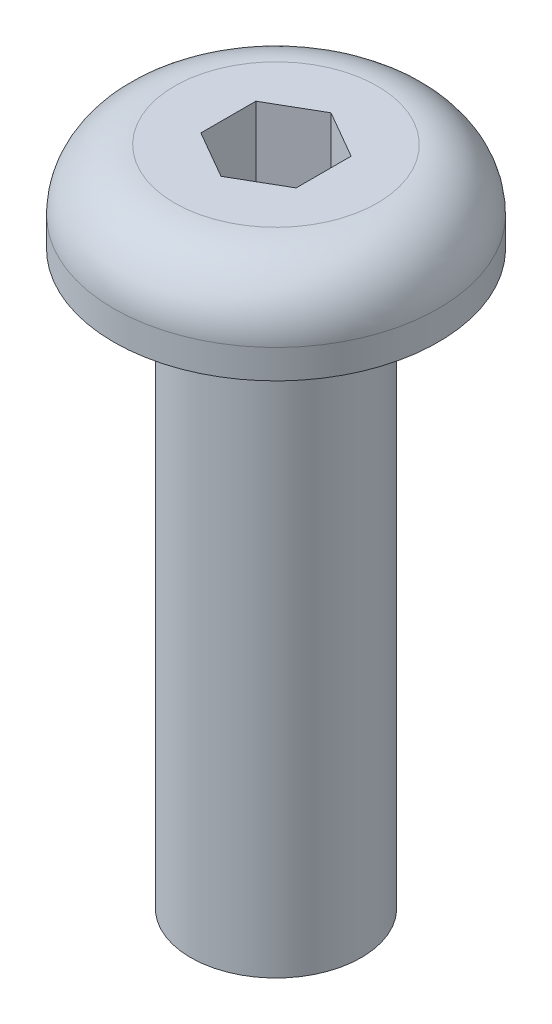
ISO-10303-21;
HEADER;
FILE_DESCRIPTION(('STEP AP214'),'2;1');
FILE_NAME('part.step','',(''),(''),'','','');
FILE_SCHEMA(('AUTOMOTIVE_DESIGN { 1 0 10303 214 1 1 1 1 }'));
ENDSEC;
DATA;
#1=APPLICATION_CONTEXT('core data for automotive mechanical design processes');
#2=APPLICATION_PROTOCOL_DEFINITION('international standard','automotive_design',2000,#1);
#3=PRODUCT_CONTEXT('',#1,'mechanical');
#4=PRODUCT('Part','Part','',(#3));
#5=PRODUCT_RELATED_PRODUCT_CATEGORY('part','',(#4));
#6=PRODUCT_DEFINITION_FORMATION('','',#4);
#7=PRODUCT_DEFINITION_CONTEXT('part definition',#1,'design');
#8=PRODUCT_DEFINITION('design','',#6,#7);
#9=PRODUCT_DEFINITION_SHAPE('','',#8);
#10=(LENGTH_UNIT() NAMED_UNIT(*) SI_UNIT(.MILLI.,.METRE.));
#11=(NAMED_UNIT(*) PLANE_ANGLE_UNIT() SI_UNIT($,.RADIAN.));
#12=(NAMED_UNIT(*) SI_UNIT($,.STERADIAN.) SOLID_ANGLE_UNIT());
#13=UNCERTAINTY_MEASURE_WITH_UNIT(LENGTH_MEASURE(1.E-05),#10,'distance_accuracy_value','');
#14=(GEOMETRIC_REPRESENTATION_CONTEXT(3) GLOBAL_UNCERTAINTY_ASSIGNED_CONTEXT((#13)) GLOBAL_UNIT_ASSIGNED_CONTEXT((#10,
#11,#12)) REPRESENTATION_CONTEXT('',''));
#15=CARTESIAN_POINT('',(0.,0.,0.));
#16=DIRECTION('',(0.,0.,1.));
#17=DIRECTION('',(1.,0.,0.));
#18=AXIS2_PLACEMENT_3D('',#15,#16,#17);
#19=CARTESIAN_POINT('',(0.,9.525,0.));
#20=DIRECTION('',(0.,-1.,0.));
#21=DIRECTION('',(0.,0.,-1.));
#22=AXIS2_PLACEMENT_3D('',#19,#20,#21);
#23=CYLINDRICAL_SURFACE('',#22,1.4224);
#24=CARTESIAN_POINT('',(0.,9.525,0.));
#25=DIRECTION('',(0.,1.,0.));
#26=DIRECTION('',(0.,0.,1.));
#27=AXIS2_PLACEMENT_3D('',#24,#25,#26);
#28=CIRCLE('',#27,1.4224);
#29=CARTESIAN_POINT('',(0.,9.525,1.4224));
#30=VERTEX_POINT('',#29);
#31=EDGE_CURVE('E141',#30,#30,#28,.T.);
#32=ORIENTED_EDGE('',*,*,#31,.F.);
#33=EDGE_LOOP('',(#32));
#34=FACE_BOUND('',#33,.T.);
#35=CARTESIAN_POINT('',(0.,0.,0.));
#36=DIRECTION('',(0.,1.,0.));
#37=DIRECTION('',(0.,0.,1.));
#38=AXIS2_PLACEMENT_3D('',#35,#36,#37);
#39=CIRCLE('',#38,1.4224);
#40=CARTESIAN_POINT('',(0.,0.,1.4224));
#41=VERTEX_POINT('',#40);
#42=EDGE_CURVE('E140',#41,#41,#39,.T.);
#43=ORIENTED_EDGE('',*,*,#42,.T.);
#44=EDGE_LOOP('',(#43));
#45=FACE_BOUND('',#44,.T.);
#46=ADVANCED_FACE('F30',(#34,#45),#23,.T.);
#47=CARTESIAN_POINT('',(0.,0.,0.));
#48=DIRECTION('',(0.,1.,0.));
#49=DIRECTION('',(0.,0.,1.));
#50=AXIS2_PLACEMENT_3D('',#47,#48,#49);
#51=PLANE('',#50);
#52=ORIENTED_EDGE('',*,*,#42,.F.);
#53=EDGE_LOOP('',(#52));
#54=FACE_BOUND('',#53,.T.);
#55=ADVANCED_FACE('F164',(#54),#51,.F.);
#56=CARTESIAN_POINT('',(0.,9.525,0.));
#57=DIRECTION('',(0.,1.,0.));
#58=DIRECTION('',(0.,0.,1.));
#59=AXIS2_PLACEMENT_3D('',#56,#57,#58);
#60=PLANE('',#59);
#61=CARTESIAN_POINT('',(0.,9.525,0.));
#62=DIRECTION('',(0.,1.,0.));
#63=DIRECTION('',(0.,0.,1.));
#64=AXIS2_PLACEMENT_3D('',#61,#62,#63);
#65=CIRCLE('',#64,2.7051);
#66=CARTESIAN_POINT('',(0.,9.525,2.7051));
#67=VERTEX_POINT('',#66);
#68=EDGE_CURVE('E132',#67,#67,#65,.T.);
#69=ORIENTED_EDGE('',*,*,#68,.F.);
#70=EDGE_LOOP('',(#69));
#71=FACE_BOUND('',#70,.T.);
#72=ORIENTED_EDGE('',*,*,#31,.T.);
#73=EDGE_LOOP('',(#72));
#74=FACE_BOUND('',#73,.T.);
#75=ADVANCED_FACE('F169',(#71,#74),#60,.F.);
#76=CARTESIAN_POINT('',(0.,11.0236,0.));
#77=DIRECTION('',(0.,-1.,0.));
#78=DIRECTION('',(0.,0.,-1.));
#79=AXIS2_PLACEMENT_3D('',#76,#77,#78);
#80=CYLINDRICAL_SURFACE('',#79,2.7051);
#81=CARTESIAN_POINT('',(0.,10.0076,0.));
#82=DIRECTION('',(0.,1.,0.));
#83=DIRECTION('',(0.,0.,1.));
#84=AXIS2_PLACEMENT_3D('',#81,#82,#83);
#85=CIRCLE('',#84,2.7051);
#86=CARTESIAN_POINT('',(0.,10.0076,2.7051));
#87=VERTEX_POINT('',#86);
#88=EDGE_CURVE('E11',#87,#87,#85,.F.);
#89=ORIENTED_EDGE('',*,*,#88,.T.);
#90=EDGE_LOOP('',(#89));
#91=FACE_BOUND('',#90,.T.);
#92=ORIENTED_EDGE('',*,*,#68,.T.);
#93=EDGE_LOOP('',(#92));
#94=FACE_BOUND('',#93,.T.);
#95=ADVANCED_FACE('F159',(#91,#94),#80,.T.);
#96=CARTESIAN_POINT('',(0.,11.0236,0.));
#97=DIRECTION('',(0.,1.,0.));
#98=DIRECTION('',(0.,0.,1.));
#99=AXIS2_PLACEMENT_3D('',#96,#97,#98);
#100=PLANE('',#99);
#101=DIRECTION('',(-0.866025403784438,0.,-0.5));
#102=VECTOR('',#101,1.);
#103=CARTESIAN_POINT('',(0.79375,11.0236,-0.458271776169266));
#104=LINE('',#103,#102);
#105=CARTESIAN_POINT('',(0.79375,11.0236,-0.458271776169266));
#106=VERTEX_POINT('',#105);
#107=CARTESIAN_POINT('',(0.,11.0236,-0.916543552338531));
#108=VERTEX_POINT('',#107);
#109=EDGE_CURVE('E45',#106,#108,#104,.T.);
#110=ORIENTED_EDGE('',*,*,#109,.F.);
#111=DIRECTION('',(0.,0.,-1.));
#112=VECTOR('',#111,1.);
#113=CARTESIAN_POINT('',(0.79375,11.0236,0.458271776169266));
#114=LINE('',#113,#112);
#115=CARTESIAN_POINT('',(0.79375,11.0236,0.458271776169266));
#116=VERTEX_POINT('',#115);
#117=EDGE_CURVE('E128',#116,#106,#114,.T.);
#118=ORIENTED_EDGE('',*,*,#117,.F.);
#119=DIRECTION('',(0.866025403784439,0.,-0.5));
#120=VECTOR('',#119,1.);
#121=CARTESIAN_POINT('',(0.,11.0236,0.916543552338531));
#122=LINE('',#121,#120);
#123=CARTESIAN_POINT('',(0.,11.0236,0.916543552338531));
#124=VERTEX_POINT('',#123);
#125=EDGE_CURVE('E126',#124,#116,#122,.T.);
#126=ORIENTED_EDGE('',*,*,#125,.F.);
#127=DIRECTION('',(0.866025403784439,0.,0.5));
#128=VECTOR('',#127,1.);
#129=CARTESIAN_POINT('',(-0.79375,11.0236,0.458271776169265));
#130=LINE('',#129,#128);
#131=CARTESIAN_POINT('',(-0.79375,11.0236,0.458271776169265));
#132=VERTEX_POINT('',#131);
#133=EDGE_CURVE('E93',#132,#124,#130,.T.);
#134=ORIENTED_EDGE('',*,*,#133,.F.);
#135=DIRECTION('',(0.,0.,1.));
#136=VECTOR('',#135,1.);
#137=CARTESIAN_POINT('',(-0.79375,11.0236,-0.458271776169265));
#138=LINE('',#137,#136);
#139=CARTESIAN_POINT('',(-0.79375,11.0236,-0.458271776169265));
#140=VERTEX_POINT('',#139);
#141=EDGE_CURVE('E122',#140,#132,#138,.T.);
#142=ORIENTED_EDGE('',*,*,#141,.F.);
#143=DIRECTION('',(-0.866025403784438,0.,0.5));
#144=VECTOR('',#143,1.);
#145=CARTESIAN_POINT('',(0.,11.0236,-0.916543552338531));
#146=LINE('',#145,#144);
#147=EDGE_CURVE('E119',#108,#140,#146,.T.);
#148=ORIENTED_EDGE('',*,*,#147,.F.);
#149=EDGE_LOOP('',(#110,#118,#126,#134,#142,#148));
#150=FACE_BOUND('',#149,.T.);
#151=CARTESIAN_POINT('',(0.,11.0236,0.));
#152=DIRECTION('',(0.,1.,0.));
#153=DIRECTION('',(0.,0.,1.));
#154=AXIS2_PLACEMENT_3D('',#151,#152,#153);
#155=CIRCLE('',#154,1.6891);
#156=CARTESIAN_POINT('',(0.,11.0236,1.6891));
#157=VERTEX_POINT('',#156);
#158=EDGE_CURVE('E38',#157,#157,#155,.T.);
#159=ORIENTED_EDGE('',*,*,#158,.T.);
#160=EDGE_LOOP('',(#159));
#161=FACE_BOUND('',#160,.T.);
#162=ADVANCED_FACE('F148',(#150,#161),#100,.T.);
#163=CARTESIAN_POINT('',(0.,10.0076,0.));
#164=DIRECTION('',(0.,1.,0.));
#165=DIRECTION('',(0.,0.,1.));
#166=AXIS2_PLACEMENT_3D('',#163,#164,#165);
#167=TOROIDAL_SURFACE('',#166,1.6891,1.016);
#168=ORIENTED_EDGE('',*,*,#88,.F.);
#169=EDGE_LOOP('',(#168));
#170=FACE_BOUND('',#169,.T.);
#171=ORIENTED_EDGE('',*,*,#158,.F.);
#172=EDGE_LOOP('',(#171));
#173=FACE_BOUND('',#172,.T.);
#174=ADVANCED_FACE('F32',(#170,#173),#167,.T.);
#175=CARTESIAN_POINT('',(0.79375,8.64235,-0.458271776169266));
#176=DIRECTION('',(0.5,0.,-0.866025403784439));
#177=DIRECTION('',(-0.866025403784438,0.,-0.5));
#178=AXIS2_PLACEMENT_3D('',#175,#176,#177);
#179=PLANE('',#178);
#180=ORIENTED_EDGE('',*,*,#109,.T.);
#181=DIRECTION('',(0.,1.,0.));
#182=VECTOR('',#181,1.);
#183=CARTESIAN_POINT('',(0.,8.64235,-0.916543552338531));
#184=LINE('',#183,#182);
#185=CARTESIAN_POINT('',(0.,8.64235,-0.916543552338531));
#186=VERTEX_POINT('',#185);
#187=EDGE_CURVE('E75',#186,#108,#184,.T.);
#188=ORIENTED_EDGE('',*,*,#187,.F.);
#189=DIRECTION('',(-0.866025403784438,0.,-0.5));
#190=VECTOR('',#189,1.);
#191=CARTESIAN_POINT('',(0.79375,8.64235,-0.458271776169266));
#192=LINE('',#191,#190);
#193=CARTESIAN_POINT('',(0.79375,8.64235,-0.458271776169266));
#194=VERTEX_POINT('',#193);
#195=EDGE_CURVE('E130',#194,#186,#192,.T.);
#196=ORIENTED_EDGE('',*,*,#195,.F.);
#197=DIRECTION('',(0.,1.,0.));
#198=VECTOR('',#197,1.);
#199=CARTESIAN_POINT('',(0.79375,8.64235,-0.458271776169266));
#200=LINE('',#199,#198);
#201=EDGE_CURVE('E53',#194,#106,#200,.T.);
#202=ORIENTED_EDGE('',*,*,#201,.T.);
#203=EDGE_LOOP('',(#180,#188,#196,#202));
#204=FACE_BOUND('',#203,.T.);
#205=ADVANCED_FACE('F151',(#204),#179,.F.);
#206=CARTESIAN_POINT('',(0.79375,8.64235,0.458271776169266));
#207=DIRECTION('',(1.,0.,0.));
#208=DIRECTION('',(0.,0.,-1.));
#209=AXIS2_PLACEMENT_3D('',#206,#207,#208);
#210=PLANE('',#209);
#211=ORIENTED_EDGE('',*,*,#117,.T.);
#212=ORIENTED_EDGE('',*,*,#201,.F.);
#213=DIRECTION('',(0.,0.,-1.));
#214=VECTOR('',#213,1.);
#215=CARTESIAN_POINT('',(0.79375,8.64235,0.458271776169266));
#216=LINE('',#215,#214);
#217=CARTESIAN_POINT('',(0.79375,8.64235,0.458271776169266));
#218=VERTEX_POINT('',#217);
#219=EDGE_CURVE('E105',#218,#194,#216,.T.);
#220=ORIENTED_EDGE('',*,*,#219,.F.);
#221=DIRECTION('',(0.,1.,0.));
#222=VECTOR('',#221,1.);
#223=CARTESIAN_POINT('',(0.79375,8.64235,0.458271776169266));
#224=LINE('',#223,#222);
#225=EDGE_CURVE('E97',#218,#116,#224,.T.);
#226=ORIENTED_EDGE('',*,*,#225,.T.);
#227=EDGE_LOOP('',(#211,#212,#220,#226));
#228=FACE_BOUND('',#227,.T.);
#229=ADVANCED_FACE('F157',(#228),#210,.F.);
#230=CARTESIAN_POINT('',(0.,8.64235,0.916543552338531));
#231=DIRECTION('',(0.5,0.,0.866025403784439));
#232=DIRECTION('',(0.866025403784439,0.,-0.5));
#233=AXIS2_PLACEMENT_3D('',#230,#231,#232);
#234=PLANE('',#233);
#235=ORIENTED_EDGE('',*,*,#125,.T.);
#236=ORIENTED_EDGE('',*,*,#225,.F.);
#237=DIRECTION('',(0.866025403784439,0.,-0.5));
#238=VECTOR('',#237,1.);
#239=CARTESIAN_POINT('',(0.,8.64235,0.916543552338531));
#240=LINE('',#239,#238);
#241=CARTESIAN_POINT('',(0.,8.64235,0.916543552338531));
#242=VERTEX_POINT('',#241);
#243=EDGE_CURVE('E101',#242,#218,#240,.T.);
#244=ORIENTED_EDGE('',*,*,#243,.F.);
#245=DIRECTION('',(0.,1.,0.));
#246=VECTOR('',#245,1.);
#247=CARTESIAN_POINT('',(0.,8.64235,0.916543552338531));
#248=LINE('',#247,#246);
#249=EDGE_CURVE('E86',#242,#124,#248,.T.);
#250=ORIENTED_EDGE('',*,*,#249,.T.);
#251=EDGE_LOOP('',(#235,#236,#244,#250));
#252=FACE_BOUND('',#251,.T.);
#253=ADVANCED_FACE('F102',(#252),#234,.F.);
#254=CARTESIAN_POINT('',(-0.79375,8.64235,0.458271776169265));
#255=DIRECTION('',(-0.5,0.,0.866025403784439));
#256=DIRECTION('',(0.866025403784438,0.,0.5));
#257=AXIS2_PLACEMENT_3D('',#254,#255,#256);
#258=PLANE('',#257);
#259=ORIENTED_EDGE('',*,*,#133,.T.);
#260=ORIENTED_EDGE('',*,*,#249,.F.);
#261=DIRECTION('',(0.866025403784439,0.,0.5));
#262=VECTOR('',#261,1.);
#263=CARTESIAN_POINT('',(-0.79375,8.64235,0.458271776169265));
#264=LINE('',#263,#262);
#265=CARTESIAN_POINT('',(-0.79375,8.64235,0.458271776169265));
#266=VERTEX_POINT('',#265);
#267=EDGE_CURVE('E90',#266,#242,#264,.T.);
#268=ORIENTED_EDGE('',*,*,#267,.F.);
#269=DIRECTION('',(0.,1.,0.));
#270=VECTOR('',#269,1.);
#271=CARTESIAN_POINT('',(-0.79375,8.64235,0.458271776169265));
#272=LINE('',#271,#270);
#273=EDGE_CURVE('E98',#266,#132,#272,.T.);
#274=ORIENTED_EDGE('',*,*,#273,.T.);
#275=EDGE_LOOP('',(#259,#260,#268,#274));
#276=FACE_BOUND('',#275,.T.);
#277=ADVANCED_FACE('F88',(#276),#258,.F.);
#278=CARTESIAN_POINT('',(-0.79375,8.64235,-0.458271776169265));
#279=DIRECTION('',(-1.,0.,0.));
#280=DIRECTION('',(0.,0.,1.));
#281=AXIS2_PLACEMENT_3D('',#278,#279,#280);
#282=PLANE('',#281);
#283=ORIENTED_EDGE('',*,*,#141,.T.);
#284=ORIENTED_EDGE('',*,*,#273,.F.);
#285=DIRECTION('',(0.,0.,1.));
#286=VECTOR('',#285,1.);
#287=CARTESIAN_POINT('',(-0.79375,8.64235,-0.458271776169265));
#288=LINE('',#287,#286);
#289=CARTESIAN_POINT('',(-0.79375,8.64235,-0.458271776169265));
#290=VERTEX_POINT('',#289);
#291=EDGE_CURVE('E111',#290,#266,#288,.T.);
#292=ORIENTED_EDGE('',*,*,#291,.F.);
#293=DIRECTION('',(0.,1.,0.));
#294=VECTOR('',#293,1.);
#295=CARTESIAN_POINT('',(-0.79375,8.64235,-0.458271776169265));
#296=LINE('',#295,#294);
#297=EDGE_CURVE('E135',#290,#140,#296,.T.);
#298=ORIENTED_EDGE('',*,*,#297,.T.);
#299=EDGE_LOOP('',(#283,#284,#292,#298));
#300=FACE_BOUND('',#299,.T.);
#301=ADVANCED_FACE('F184',(#300),#282,.F.);
#302=CARTESIAN_POINT('',(0.,8.64235,-0.916543552338531));
#303=DIRECTION('',(-0.5,0.,-0.866025403784439));
#304=DIRECTION('',(-0.866025403784438,0.,0.5));
#305=AXIS2_PLACEMENT_3D('',#302,#303,#304);
#306=PLANE('',#305);
#307=ORIENTED_EDGE('',*,*,#147,.T.);
#308=ORIENTED_EDGE('',*,*,#297,.F.);
#309=DIRECTION('',(-0.866025403784438,0.,0.5));
#310=VECTOR('',#309,1.);
#311=CARTESIAN_POINT('',(0.,8.64235,-0.916543552338531));
#312=LINE('',#311,#310);
#313=EDGE_CURVE('E113',#186,#290,#312,.T.);
#314=ORIENTED_EDGE('',*,*,#313,.F.);
#315=ORIENTED_EDGE('',*,*,#187,.T.);
#316=EDGE_LOOP('',(#307,#308,#314,#315));
#317=FACE_BOUND('',#316,.T.);
#318=ADVANCED_FACE('F181',(#317),#306,.F.);
#319=CARTESIAN_POINT('',(0.,8.64235,-0.916543552338531));
#320=DIRECTION('',(0.,1.,0.));
#321=DIRECTION('',(0.,0.,1.));
#322=AXIS2_PLACEMENT_3D('',#319,#320,#321);
#323=PLANE('',#322);
#324=ORIENTED_EDGE('',*,*,#195,.T.);
#325=ORIENTED_EDGE('',*,*,#313,.T.);
#326=ORIENTED_EDGE('',*,*,#291,.T.);
#327=ORIENTED_EDGE('',*,*,#267,.T.);
#328=ORIENTED_EDGE('',*,*,#243,.T.);
#329=ORIENTED_EDGE('',*,*,#219,.T.);
#330=EDGE_LOOP('',(#324,#325,#326,#327,#328,#329));
#331=FACE_BOUND('',#330,.T.);
#332=ADVANCED_FACE('F108',(#331),#323,.T.);
#333=CLOSED_SHELL('',(#46,#55,#75,#95,#162,#174,#205,#229,#253,#277,#301,#318,#332));
#334=MANIFOLD_SOLID_BREP('B2',#333);
#335=ADVANCED_BREP_SHAPE_REPRESENTATION('',(#18,#334),#14);
#336=SHAPE_DEFINITION_REPRESENTATION(#9,#335);
ENDSEC;
END-ISO-10303-21;
